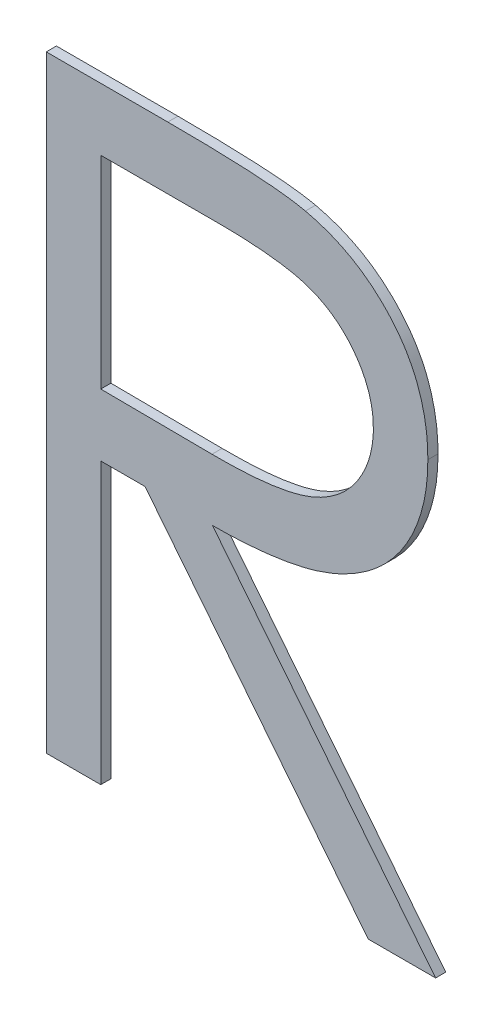
ISO-10303-21;
HEADER;
FILE_DESCRIPTION(('STEP AP214'),'2;1');
FILE_NAME('part.step','',(''),(''),'','','');
FILE_SCHEMA(('AUTOMOTIVE_DESIGN { 1 0 10303 214 1 1 1 1 }'));
ENDSEC;
DATA;
#1=APPLICATION_CONTEXT('core data for automotive mechanical design processes');
#2=APPLICATION_PROTOCOL_DEFINITION('international standard','automotive_design',2000,#1);
#3=PRODUCT_CONTEXT('',#1,'mechanical');
#4=PRODUCT('Part','Part','',(#3));
#5=PRODUCT_RELATED_PRODUCT_CATEGORY('part','',(#4));
#6=PRODUCT_DEFINITION_FORMATION('','',#4);
#7=PRODUCT_DEFINITION_CONTEXT('part definition',#1,'design');
#8=PRODUCT_DEFINITION('design','',#6,#7);
#9=PRODUCT_DEFINITION_SHAPE('','',#8);
#10=(LENGTH_UNIT() NAMED_UNIT(*) SI_UNIT(.MILLI.,.METRE.));
#11=(NAMED_UNIT(*) PLANE_ANGLE_UNIT() SI_UNIT($,.RADIAN.));
#12=(NAMED_UNIT(*) SI_UNIT($,.STERADIAN.) SOLID_ANGLE_UNIT());
#13=UNCERTAINTY_MEASURE_WITH_UNIT(LENGTH_MEASURE(1.E-05),#10,'distance_accuracy_value','');
#14=(GEOMETRIC_REPRESENTATION_CONTEXT(3) GLOBAL_UNCERTAINTY_ASSIGNED_CONTEXT((#13)) GLOBAL_UNIT_ASSIGNED_CONTEXT((#10,
#11,#12)) REPRESENTATION_CONTEXT('',''));
#15=CARTESIAN_POINT('',(0.,0.,0.));
#16=DIRECTION('',(0.,0.,1.));
#17=DIRECTION('',(1.,0.,0.));
#18=AXIS2_PLACEMENT_3D('',#15,#16,#17);
#19=CARTESIAN_POINT('',(0.729593874590072,0.249930146715529,0.551));
#20=DIRECTION('',(0.,0.,1.));
#21=DIRECTION('',(1.,0.,0.));
#22=AXIS2_PLACEMENT_3D('',#19,#20,#21);
#23=PLANE('',#22);
#24=DIRECTION('',(0.,1.,0.));
#25=VECTOR('',#24,1.);
#26=CARTESIAN_POINT('',(0.710769230769231,0.190058603834586,0.551));
#27=LINE('',#26,#25);
#28=CARTESIAN_POINT('',(0.710769230769231,0.190058603834586,0.551));
#29=VERTEX_POINT('',#28);
#30=CARTESIAN_POINT('',(0.710769230769231,0.250058603834586,0.551));
#31=VERTEX_POINT('',#30);
#32=EDGE_CURVE('E11',#29,#31,#27,.T.);
#33=ORIENTED_EDGE('',*,*,#32,.F.);
#34=DIRECTION('',(-1.,0.,0.));
#35=VECTOR('',#34,1.);
#36=CARTESIAN_POINT('',(0.716153846153846,0.190058603834586,0.551));
#37=LINE('',#36,#35);
#38=CARTESIAN_POINT('',(0.716153846153846,0.190058603834586,0.551));
#39=VERTEX_POINT('',#38);
#40=EDGE_CURVE('E364',#39,#29,#37,.T.);
#41=ORIENTED_EDGE('',*,*,#40,.F.);
#42=DIRECTION('',(0.,-1.,0.));
#43=VECTOR('',#42,1.);
#44=CARTESIAN_POINT('',(0.716153846153846,0.217750911526894,0.551));
#45=LINE('',#44,#43);
#46=CARTESIAN_POINT('',(0.716153846153846,0.217750911526894,0.551));
#47=VERTEX_POINT('',#46);
#48=EDGE_CURVE('E354',#47,#39,#45,.T.);
#49=ORIENTED_EDGE('',*,*,#48,.F.);
#50=DIRECTION('',(-1.,0.,0.));
#51=VECTOR('',#50,1.);
#52=CARTESIAN_POINT('',(0.720528846153846,0.217750911526894,0.551));
#53=LINE('',#52,#51);
#54=CARTESIAN_POINT('',(0.720528846153846,0.217750911526894,0.551));
#55=VERTEX_POINT('',#54);
#56=EDGE_CURVE('E373',#55,#47,#53,.T.);
#57=ORIENTED_EDGE('',*,*,#56,.F.);
#58=DIRECTION('',(-0.622788232243937,0.782390450976027,0.));
#59=VECTOR('',#58,1.);
#60=CARTESIAN_POINT('',(0.742572115384615,0.190058603834586,0.551));
#61=LINE('',#60,#59);
#62=CARTESIAN_POINT('',(0.742572115384615,0.190058603834586,0.551));
#63=VERTEX_POINT('',#62);
#64=EDGE_CURVE('E309',#63,#55,#61,.T.);
#65=ORIENTED_EDGE('',*,*,#64,.F.);
#66=DIRECTION('',(-1.,0.,0.));
#67=VECTOR('',#66,1.);
#68=CARTESIAN_POINT('',(0.749230769230769,0.190058603834586,0.551));
#69=LINE('',#68,#67);
#70=CARTESIAN_POINT('',(0.749230769230769,0.190058603834586,0.551));
#71=VERTEX_POINT('',#70);
#72=EDGE_CURVE('E331',#71,#63,#69,.T.);
#73=ORIENTED_EDGE('',*,*,#72,.F.);
#74=DIRECTION('',(0.622788232243938,-0.782390450976027,0.));
#75=VECTOR('',#74,1.);
#76=CARTESIAN_POINT('',(0.7271875,0.217750911526894,0.551));
#77=LINE('',#76,#75);
#78=CARTESIAN_POINT('',(0.7271875,0.217750911526894,0.551));
#79=VERTEX_POINT('',#78);
#80=EDGE_CURVE('E403',#79,#71,#77,.T.);
#81=ORIENTED_EDGE('',*,*,#80,.F.);
#82=CARTESIAN_POINT('',(0.748461538461538,0.234012930757663,0.551));
#83=CARTESIAN_POINT('',(0.748468911700596,0.233208143029153,0.551));
#84=CARTESIAN_POINT('',(0.748420557237185,0.232399911940369,0.551));
#85=CARTESIAN_POINT('',(0.748120113666604,0.230127209417305,0.551));
#86=CARTESIAN_POINT('',(0.747731522408942,0.228678847628025,0.551));
#87=CARTESIAN_POINT('',(0.746544841874727,0.225958693063811,0.551));
#88=CARTESIAN_POINT('',(0.745747972126269,0.224686388699115,0.551));
#89=CARTESIAN_POINT('',(0.743849150234613,0.222531767884124,0.551));
#90=CARTESIAN_POINT('',(0.742768337116624,0.22163065298831,0.551));
#91=CARTESIAN_POINT('',(0.740399152208515,0.220139298122198,0.551));
#92=CARTESIAN_POINT('',(0.739108595848468,0.219552644845234,0.551));
#93=CARTESIAN_POINT('',(0.73657051803808,0.21872384228478,0.551));
#94=CARTESIAN_POINT('',(0.735331493605481,0.218453220566358,0.551));
#95=CARTESIAN_POINT('',(0.732690372931943,0.218030038474797,0.551));
#96=CARTESIAN_POINT('',(0.731285937742286,0.217894675771569,0.551));
#97=CARTESIAN_POINT('',(0.728981924895038,0.217774955225404,0.551));
#98=CARTESIAN_POINT('',(0.728084212855654,0.217753612277355,0.551));
#99=CARTESIAN_POINT('',(0.7271875,0.217750911526894,0.551));
#100=B_SPLINE_CURVE_WITH_KNOTS('',3,(#82,#83,#84,#85,#86,#87,#88,#89,#90,#91,#92,#93,#94,#95,
#96,#97,#98,#99),.UNSPECIFIED.,.F.,.F.,(4,2,2,2,2,2,2,2,4),(0.,0.00241891941124372,
0.00685955805685283,0.011287009178321,0.0154491961450874,0.01965789723926,0.0234477900413579,
0.0276743955237375,0.0303661860529436),.UNSPECIFIED.);
#101=CARTESIAN_POINT('',(0.748461538461538,0.234012930757663,0.551));
#102=VERTEX_POINT('',#101);
#103=EDGE_CURVE('E264',#102,#79,#100,.T.);
#104=ORIENTED_EDGE('',*,*,#103,.F.);
#105=CARTESIAN_POINT('',(0.736370192307692,0.249241296142279,0.551));
#106=CARTESIAN_POINT('',(0.736814621233678,0.249141816509164,0.551));
#107=CARTESIAN_POINT('',(0.737256263849048,0.249024335619531,0.551));
#108=CARTESIAN_POINT('',(0.739133772910085,0.248441927544628,0.551));
#109=CARTESIAN_POINT('',(0.740520888839427,0.247799194506053,0.551));
#110=CARTESIAN_POINT('',(0.743004900221706,0.246142282236043,0.551));
#111=CARTESIAN_POINT('',(0.74410771152211,0.245136941255291,0.551));
#112=CARTESIAN_POINT('',(0.745627620083069,0.243316636377099,0.551));
#113=CARTESIAN_POINT('',(0.7461439359523,0.242581925539822,0.551));
#114=CARTESIAN_POINT('',(0.747219977404266,0.240661178806735,0.551));
#115=CARTESIAN_POINT('',(0.747689059581505,0.239423710248342,0.551));
#116=CARTESIAN_POINT('',(0.748327789570586,0.236791112392058,0.551));
#117=CARTESIAN_POINT('',(0.748477583119755,0.235390973589226,0.551));
#118=CARTESIAN_POINT('',(0.748461538461538,0.234012930757663,0.551));
#119=B_SPLINE_CURVE_WITH_KNOTS('',3,(#105,#106,#107,#108,#109,#110,#111,#112,#113,#114,#115,
#116,#117,#118),.UNSPECIFIED.,.F.,.F.,(4,2,2,2,2,2,4),(0.,0.00136892634506014,
0.00588529537116032,0.0102982950077621,0.0129784776065322,0.0168999545398443,
0.0210589177920533),.UNSPECIFIED.);
#120=CARTESIAN_POINT('',(0.736370192307692,0.249241296142279,0.551));
#121=VERTEX_POINT('',#120);
#122=EDGE_CURVE('E132',#121,#102,#119,.T.);
#123=ORIENTED_EDGE('',*,*,#122,.F.);
#124=CARTESIAN_POINT('',(0.722776442307692,0.250058603834586,0.551));
#125=CARTESIAN_POINT('',(0.723585145099272,0.250061474272542,0.551));
#126=CARTESIAN_POINT('',(0.724393816739937,0.250057101550622,0.551));
#127=CARTESIAN_POINT('',(0.726528629412481,0.250028845168755,0.551));
#128=CARTESIAN_POINT('',(0.72785463259487,0.249994263254859,0.551));
#129=CARTESIAN_POINT('',(0.729644336331593,0.249930023446547,0.551));
#130=CARTESIAN_POINT('',(0.730108424548216,0.249911769882156,0.551));
#131=CARTESIAN_POINT('',(0.730973675598888,0.249867137390712,0.551));
#132=CARTESIAN_POINT('',(0.731374916315879,0.24984217945201,0.551));
#133=CARTESIAN_POINT('',(0.732474565295955,0.249767097745879,0.551));
#134=CARTESIAN_POINT('',(0.733172794390911,0.249712032679128,0.551));
#135=CARTESIAN_POINT('',(0.734707430096043,0.24954342377603,0.551));
#136=CARTESIAN_POINT('',(0.735542675711379,0.249420171128783,0.551));
#137=CARTESIAN_POINT('',(0.736370192394004,0.249241296124493,0.551));
#138=B_SPLINE_CURVE_WITH_KNOTS('',3,(#124,#125,#126,#127,#128,#129,#130,#131,#132,#133,#134,
#135,#136,#137),.UNSPECIFIED.,.F.,.F.,(4,2,2,2,2,2,4),(0.,0.00242599521258422,
0.00640503198263672,0.0077982829429581,0.00900436448876861,0.0111044226708355,
0.0136370297981742),.UNSPECIFIED.);
#139=CARTESIAN_POINT('',(0.722776442307692,0.250058603834586,0.551));
#140=VERTEX_POINT('',#139);
#141=EDGE_CURVE('E125',#140,#121,#138,.T.);
#142=ORIENTED_EDGE('',*,*,#141,.F.);
#143=DIRECTION('',(1.,0.,0.));
#144=VECTOR('',#143,1.);
#145=CARTESIAN_POINT('',(0.710769230769231,0.250058603834586,0.551));
#146=LINE('',#145,#144);
#147=EDGE_CURVE('E129',#31,#140,#146,.T.);
#148=ORIENTED_EDGE('',*,*,#147,.F.);
#149=EDGE_LOOP('',(#33,#41,#49,#57,#65,#73,#81,#104,#123,#142,#148));
#150=FACE_BOUND('',#149,.T.);
#151=DIRECTION('',(0.,-1.,0.));
#152=VECTOR('',#151,1.);
#153=CARTESIAN_POINT('',(0.716153846153846,0.24390475768074,0.551));
#154=LINE('',#153,#152);
#155=CARTESIAN_POINT('',(0.716153846153846,0.24390475768074,0.551));
#156=VERTEX_POINT('',#155);
#157=CARTESIAN_POINT('',(0.716153846153846,0.22390475768074,0.551));
#158=VERTEX_POINT('',#157);
#159=EDGE_CURVE('E356',#156,#158,#154,.T.);
#160=ORIENTED_EDGE('',*,*,#159,.F.);
#161=DIRECTION('',(-1.,0.,0.));
#162=VECTOR('',#161,1.);
#163=CARTESIAN_POINT('',(0.727403846153846,0.24390475768074,0.551));
#164=LINE('',#163,#162);
#165=CARTESIAN_POINT('',(0.727403846153846,0.24390475768074,0.551));
#166=VERTEX_POINT('',#165);
#167=EDGE_CURVE('E350',#166,#156,#164,.T.);
#168=ORIENTED_EDGE('',*,*,#167,.F.);
#169=CARTESIAN_POINT('',(0.743076923076923,0.234024949988433,0.551));
#170=CARTESIAN_POINT('',(0.743080847364333,0.234511612914194,0.551));
#171=CARTESIAN_POINT('',(0.743043517725224,0.234999359162641,0.551));
#172=CARTESIAN_POINT('',(0.742843166419093,0.236257419105929,0.551));
#173=CARTESIAN_POINT('',(0.742617335722384,0.237018502244953,0.551));
#174=CARTESIAN_POINT('',(0.741972370076637,0.23846242663933,0.551));
#175=CARTESIAN_POINT('',(0.741550781904315,0.239144133395163,0.551));
#176=CARTESIAN_POINT('',(0.740457132995433,0.240526408229965,0.551));
#177=CARTESIAN_POINT('',(0.739751015356322,0.24120069180154,0.551));
#178=CARTESIAN_POINT('',(0.738186860024027,0.242273630921481,0.551));
#179=CARTESIAN_POINT('',(0.737334575044372,0.242680613393515,0.551));
#180=CARTESIAN_POINT('',(0.735543851949154,0.243264518902941,0.551));
#181=CARTESIAN_POINT('',(0.734603923851095,0.24343614726552,0.551));
#182=CARTESIAN_POINT('',(0.732587365455035,0.243708053945155,0.551));
#183=CARTESIAN_POINT('',(0.731509685784592,0.243795299526175,0.551));
#184=CARTESIAN_POINT('',(0.72942229365638,0.243892071044446,0.551));
#185=CARTESIAN_POINT('',(0.728412832278127,0.24390638401215,0.551));
#186=CARTESIAN_POINT('',(0.727403846153846,0.24390475768074,0.551));
#187=B_SPLINE_CURVE_WITH_KNOTS('',3,(#169,#170,#171,#172,#173,#174,#175,#176,#177,#178,#179,
#180,#181,#182,#183,#184,#185,#186),.UNSPECIFIED.,.F.,.F.,(4,2,2,2,2,2,2,2,4),(0.,
0.00146052189542925,0.003812458810781,0.0061947003220354,0.0090788318743927,0.0118682174899967,
0.0147193788174986,0.0179620276670213,0.0209888198468878),.UNSPECIFIED.);
#188=CARTESIAN_POINT('',(0.743076923076923,0.234024949988433,0.551));
#189=VERTEX_POINT('',#188);
#190=EDGE_CURVE('E345',#189,#166,#187,.T.);
#191=ORIENTED_EDGE('',*,*,#190,.F.);
#192=CARTESIAN_POINT('',(0.727139423076923,0.223820623065356,0.551));
#193=CARTESIAN_POINT('',(0.72765665936159,0.223820500130313,0.551));
#194=CARTESIAN_POINT('',(0.728174473092298,0.22382356010618,0.551));
#195=CARTESIAN_POINT('',(0.730412078565539,0.22386433604423,0.551));
#196=CARTESIAN_POINT('',(0.732132146632148,0.223966004860115,0.551));
#197=CARTESIAN_POINT('',(0.735063563066817,0.224464243413341,0.551));
#198=CARTESIAN_POINT('',(0.736284347031616,0.224771721081371,0.551));
#199=CARTESIAN_POINT('',(0.738370757112794,0.225713816948197,0.551));
#200=CARTESIAN_POINT('',(0.739261697618529,0.226285640795418,0.551));
#201=CARTESIAN_POINT('',(0.740633969355859,0.227546913128135,0.551));
#202=CARTESIAN_POINT('',(0.741162034923664,0.228186373288074,0.551));
#203=CARTESIAN_POINT('',(0.742045773079109,0.22958609989474,0.551));
#204=CARTESIAN_POINT('',(0.742399151537132,0.230347808443954,0.551));
#205=CARTESIAN_POINT('',(0.742940357953151,0.232071540001432,0.551));
#206=CARTESIAN_POINT('',(0.74308988867121,0.233045615172945,0.551));
#207=CARTESIAN_POINT('',(0.743076923076923,0.234024949988433,0.551));
#208=B_SPLINE_CURVE_WITH_KNOTS('',3,(#192,#193,#194,#195,#196,#197,#198,#199,#200,#201,#202,
#203,#204,#205,#206,#207),.UNSPECIFIED.,.F.,.F.,(4,2,2,2,2,2,2,4),(0.,0.00155294059489081,
0.00671029616850906,0.0104448873224616,0.0135593956664882,0.0160192505473629,0.0185106045531862,
0.0214249742693337),.UNSPECIFIED.);
#209=CARTESIAN_POINT('',(0.727139423076923,0.223820623065356,0.551));
#210=VERTEX_POINT('',#209);
#211=EDGE_CURVE('E302',#210,#189,#208,.T.);
#212=ORIENTED_EDGE('',*,*,#211,.F.);
#213=DIRECTION('',(0.999970673881285,-0.0076584187277561,0.));
#214=VECTOR('',#213,1.);
#215=CARTESIAN_POINT('',(0.716153846153846,0.22390475768074,0.551));
#216=LINE('',#215,#214);
#217=EDGE_CURVE('E332',#158,#210,#216,.T.);
#218=ORIENTED_EDGE('',*,*,#217,.F.);
#219=EDGE_LOOP('',(#160,#168,#191,#212,#218));
#220=FACE_BOUND('',#219,.T.);
#221=ADVANCED_FACE('F17',(#150,#220),#23,.T.);
#222=CARTESIAN_POINT('',(0.729593874590072,0.249930146715529,0.55));
#223=DIRECTION('',(0.,0.,1.));
#224=DIRECTION('',(1.,0.,0.));
#225=AXIS2_PLACEMENT_3D('',#222,#223,#224);
#226=PLANE('',#225);
#227=DIRECTION('',(0.,1.,0.));
#228=VECTOR('',#227,1.);
#229=CARTESIAN_POINT('',(0.710769230769231,0.190058603834586,0.55));
#230=LINE('',#229,#228);
#231=CARTESIAN_POINT('',(0.710769230769231,0.190058603834586,0.55));
#232=VERTEX_POINT('',#231);
#233=CARTESIAN_POINT('',(0.710769230769231,0.250058603834586,0.55));
#234=VERTEX_POINT('',#233);
#235=EDGE_CURVE('E25',#232,#234,#230,.T.);
#236=ORIENTED_EDGE('',*,*,#235,.T.);
#237=DIRECTION('',(1.,0.,0.));
#238=VECTOR('',#237,1.);
#239=CARTESIAN_POINT('',(0.710769230769231,0.250058603834586,0.55));
#240=LINE('',#239,#238);
#241=CARTESIAN_POINT('',(0.722776442307692,0.250058603834586,0.55));
#242=VERTEX_POINT('',#241);
#243=EDGE_CURVE('E353',#234,#242,#240,.T.);
#244=ORIENTED_EDGE('',*,*,#243,.T.);
#245=CARTESIAN_POINT('',(0.722776442307692,0.250058603834586,0.55));
#246=CARTESIAN_POINT('',(0.723585145099507,0.250061474275804,0.55));
#247=CARTESIAN_POINT('',(0.724393816740083,0.250057101552648,0.55));
#248=CARTESIAN_POINT('',(0.726528629412242,0.250028845165432,0.55));
#249=CARTESIAN_POINT('',(0.727854632594238,0.249994263246085,0.55));
#250=CARTESIAN_POINT('',(0.729644337122473,0.24993002342124,0.55));
#251=CARTESIAN_POINT('',(0.730108426129917,0.249911769827856,0.55));
#252=CARTESIAN_POINT('',(0.730973678758569,0.249867137217125,0.55));
#253=CARTESIAN_POINT('',(0.731374920263071,0.249842179193905,0.55));
#254=CARTESIAN_POINT('',(0.732474568447577,0.249767097448339,0.55));
#255=CARTESIAN_POINT('',(0.73317279596092,0.24971203248205,0.55));
#256=CARTESIAN_POINT('',(0.734707430098889,0.249543423805363,0.55));
#257=CARTESIAN_POINT('',(0.735542675717145,0.249420171187483,0.55));
#258=CARTESIAN_POINT('',(0.736370192394004,0.249241296124493,0.55));
#259=B_SPLINE_CURVE_WITH_KNOTS('',3,(#245,#246,#247,#248,#249,#250,#251,#252,#253,#254,#255,
#256,#257,#258),.UNSPECIFIED.,.F.,.F.,(4,2,2,2,2,2,4),(0.,0.00242599521258422,
0.00640503198263672,0.0077982853163376,0.0090043692354748,0.0111044226709654,0.013637029798304),.UNSPECIFIED.);
#260=CARTESIAN_POINT('',(0.736370192307692,0.249241296142279,0.55));
#261=VERTEX_POINT('',#260);
#262=EDGE_CURVE('E143',#242,#261,#259,.T.);
#263=ORIENTED_EDGE('',*,*,#262,.T.);
#264=CARTESIAN_POINT('',(0.736370192307692,0.249241296142279,0.55));
#265=CARTESIAN_POINT('',(0.736814621233678,0.249141816509164,0.55));
#266=CARTESIAN_POINT('',(0.737256263849048,0.249024335619531,0.55));
#267=CARTESIAN_POINT('',(0.739133772910085,0.248441927544628,0.55));
#268=CARTESIAN_POINT('',(0.740520888839427,0.247799194506053,0.55));
#269=CARTESIAN_POINT('',(0.743004900221706,0.246142282236043,0.55));
#270=CARTESIAN_POINT('',(0.74410771152211,0.245136941255291,0.55));
#271=CARTESIAN_POINT('',(0.745627620083069,0.243316636377099,0.55));
#272=CARTESIAN_POINT('',(0.7461439359523,0.242581925539822,0.55));
#273=CARTESIAN_POINT('',(0.747219977404266,0.240661178806735,0.55));
#274=CARTESIAN_POINT('',(0.747689059581505,0.239423710248342,0.55));
#275=CARTESIAN_POINT('',(0.748327789570586,0.236791112392058,0.55));
#276=CARTESIAN_POINT('',(0.748477583119755,0.235390973589226,0.55));
#277=CARTESIAN_POINT('',(0.748461538461538,0.234012930757663,0.55));
#278=B_SPLINE_CURVE_WITH_KNOTS('',3,(#264,#265,#266,#267,#268,#269,#270,#271,#272,#273,#274,
#275,#276,#277),.UNSPECIFIED.,.F.,.F.,(4,2,2,2,2,2,4),(0.,0.00136892634506014,
0.00588529537116032,0.0102982950077621,0.0129784776065322,0.0168999545398443,
0.0210589177920533),.UNSPECIFIED.);
#279=CARTESIAN_POINT('',(0.748461538461538,0.234012930757663,0.55));
#280=VERTEX_POINT('',#279);
#281=EDGE_CURVE('E225',#261,#280,#278,.T.);
#282=ORIENTED_EDGE('',*,*,#281,.T.);
#283=CARTESIAN_POINT('',(0.748461538461538,0.234012930757663,0.55));
#284=CARTESIAN_POINT('',(0.748468911700596,0.233208143029153,0.55));
#285=CARTESIAN_POINT('',(0.748420557237185,0.232399911940369,0.55));
#286=CARTESIAN_POINT('',(0.748120113666604,0.230127209417305,0.55));
#287=CARTESIAN_POINT('',(0.747731522408942,0.228678847628025,0.55));
#288=CARTESIAN_POINT('',(0.746544841874727,0.225958693063811,0.55));
#289=CARTESIAN_POINT('',(0.745747972126269,0.224686388699115,0.55));
#290=CARTESIAN_POINT('',(0.743849150234613,0.222531767884124,0.55));
#291=CARTESIAN_POINT('',(0.742768337116624,0.22163065298831,0.55));
#292=CARTESIAN_POINT('',(0.740399152208515,0.220139298122198,0.55));
#293=CARTESIAN_POINT('',(0.739108595848468,0.219552644845234,0.55));
#294=CARTESIAN_POINT('',(0.73657051803808,0.21872384228478,0.55));
#295=CARTESIAN_POINT('',(0.735331493605481,0.218453220566358,0.55));
#296=CARTESIAN_POINT('',(0.732690372931943,0.218030038474797,0.55));
#297=CARTESIAN_POINT('',(0.731285937742286,0.217894675771569,0.55));
#298=CARTESIAN_POINT('',(0.728981924895038,0.217774955225404,0.55));
#299=CARTESIAN_POINT('',(0.728084212855654,0.217753612277355,0.55));
#300=CARTESIAN_POINT('',(0.7271875,0.217750911526894,0.55));
#301=B_SPLINE_CURVE_WITH_KNOTS('',3,(#283,#284,#285,#286,#287,#288,#289,#290,#291,#292,#293,
#294,#295,#296,#297,#298,#299,#300),.UNSPECIFIED.,.F.,.F.,(4,2,2,2,2,2,2,2,4),(0.,
0.00241891941124372,0.00685955805685283,0.011287009178321,0.0154491961450874,0.01965789723926,
0.0234477900413579,0.0276743955237375,0.0303661860529436),.UNSPECIFIED.);
#302=CARTESIAN_POINT('',(0.7271875,0.217750911526894,0.55));
#303=VERTEX_POINT('',#302);
#304=EDGE_CURVE('E217',#280,#303,#301,.T.);
#305=ORIENTED_EDGE('',*,*,#304,.T.);
#306=DIRECTION('',(0.622788232243938,-0.782390450976027,0.));
#307=VECTOR('',#306,1.);
#308=CARTESIAN_POINT('',(0.7271875,0.217750911526894,0.55));
#309=LINE('',#308,#307);
#310=CARTESIAN_POINT('',(0.749230769230769,0.190058603834586,0.55));
#311=VERTEX_POINT('',#310);
#312=EDGE_CURVE('E396',#303,#311,#309,.T.);
#313=ORIENTED_EDGE('',*,*,#312,.T.);
#314=DIRECTION('',(-1.,0.,0.));
#315=VECTOR('',#314,1.);
#316=CARTESIAN_POINT('',(0.749230769230769,0.190058603834586,0.55));
#317=LINE('',#316,#315);
#318=CARTESIAN_POINT('',(0.742572115384615,0.190058603834586,0.55));
#319=VERTEX_POINT('',#318);
#320=EDGE_CURVE('E393',#311,#319,#317,.T.);
#321=ORIENTED_EDGE('',*,*,#320,.T.);
#322=DIRECTION('',(-0.622788232243937,0.782390450976027,0.));
#323=VECTOR('',#322,1.);
#324=CARTESIAN_POINT('',(0.742572115384615,0.190058603834586,0.55));
#325=LINE('',#324,#323);
#326=CARTESIAN_POINT('',(0.720528846153846,0.217750911526894,0.55));
#327=VERTEX_POINT('',#326);
#328=EDGE_CURVE('E391',#319,#327,#325,.T.);
#329=ORIENTED_EDGE('',*,*,#328,.T.);
#330=DIRECTION('',(-1.,0.,0.));
#331=VECTOR('',#330,1.);
#332=CARTESIAN_POINT('',(0.720528846153846,0.217750911526894,0.55));
#333=LINE('',#332,#331);
#334=CARTESIAN_POINT('',(0.716153846153846,0.217750911526894,0.55));
#335=VERTEX_POINT('',#334);
#336=EDGE_CURVE('E310',#327,#335,#333,.T.);
#337=ORIENTED_EDGE('',*,*,#336,.T.);
#338=DIRECTION('',(0.,-1.,0.));
#339=VECTOR('',#338,1.);
#340=CARTESIAN_POINT('',(0.716153846153846,0.217750911526894,0.55));
#341=LINE('',#340,#339);
#342=CARTESIAN_POINT('',(0.716153846153846,0.190058603834586,0.55));
#343=VERTEX_POINT('',#342);
#344=EDGE_CURVE('E379',#335,#343,#341,.T.);
#345=ORIENTED_EDGE('',*,*,#344,.T.);
#346=DIRECTION('',(-1.,0.,0.));
#347=VECTOR('',#346,1.);
#348=CARTESIAN_POINT('',(0.716153846153846,0.190058603834586,0.55));
#349=LINE('',#348,#347);
#350=EDGE_CURVE('E388',#343,#232,#349,.T.);
#351=ORIENTED_EDGE('',*,*,#350,.T.);
#352=EDGE_LOOP('',(#236,#244,#263,#282,#305,#313,#321,#329,#337,#345,#351));
#353=FACE_BOUND('',#352,.T.);
#354=DIRECTION('',(-1.,0.,0.));
#355=VECTOR('',#354,1.);
#356=CARTESIAN_POINT('',(0.727403846153846,0.24390475768074,0.55));
#357=LINE('',#356,#355);
#358=CARTESIAN_POINT('',(0.727403846153846,0.24390475768074,0.55));
#359=VERTEX_POINT('',#358);
#360=CARTESIAN_POINT('',(0.716153846153846,0.24390475768074,0.55));
#361=VERTEX_POINT('',#360);
#362=EDGE_CURVE('E351',#359,#361,#357,.T.);
#363=ORIENTED_EDGE('',*,*,#362,.T.);
#364=DIRECTION('',(0.,-1.,0.));
#365=VECTOR('',#364,1.);
#366=CARTESIAN_POINT('',(0.716153846153846,0.24390475768074,0.55));
#367=LINE('',#366,#365);
#368=CARTESIAN_POINT('',(0.716153846153846,0.22390475768074,0.55));
#369=VERTEX_POINT('',#368);
#370=EDGE_CURVE('E187',#361,#369,#367,.T.);
#371=ORIENTED_EDGE('',*,*,#370,.T.);
#372=DIRECTION('',(0.999970673881285,-0.0076584187277561,0.));
#373=VECTOR('',#372,1.);
#374=CARTESIAN_POINT('',(0.716153846153846,0.22390475768074,0.55));
#375=LINE('',#374,#373);
#376=CARTESIAN_POINT('',(0.727139423076923,0.223820623065356,0.55));
#377=VERTEX_POINT('',#376);
#378=EDGE_CURVE('E234',#369,#377,#375,.T.);
#379=ORIENTED_EDGE('',*,*,#378,.T.);
#380=CARTESIAN_POINT('',(0.727139423076923,0.223820623065356,0.55));
#381=CARTESIAN_POINT('',(0.72765665936159,0.223820500130313,0.55));
#382=CARTESIAN_POINT('',(0.728174473092298,0.22382356010618,0.55));
#383=CARTESIAN_POINT('',(0.730412078565539,0.22386433604423,0.55));
#384=CARTESIAN_POINT('',(0.732132146632148,0.223966004860115,0.55));
#385=CARTESIAN_POINT('',(0.735063563066817,0.224464243413341,0.55));
#386=CARTESIAN_POINT('',(0.736284347031616,0.224771721081371,0.55));
#387=CARTESIAN_POINT('',(0.738370757112794,0.225713816948197,0.55));
#388=CARTESIAN_POINT('',(0.739261697618529,0.226285640795418,0.55));
#389=CARTESIAN_POINT('',(0.740633969355859,0.227546913128135,0.55));
#390=CARTESIAN_POINT('',(0.741162034923664,0.228186373288074,0.55));
#391=CARTESIAN_POINT('',(0.742045773079109,0.22958609989474,0.55));
#392=CARTESIAN_POINT('',(0.742399151537132,0.230347808443954,0.55));
#393=CARTESIAN_POINT('',(0.742940357953151,0.232071540001431,0.55));
#394=CARTESIAN_POINT('',(0.74308988867121,0.233045615172945,0.55));
#395=CARTESIAN_POINT('',(0.743076923076923,0.234024949988432,0.55));
#396=B_SPLINE_CURVE_WITH_KNOTS('',3,(#380,#381,#382,#383,#384,#385,#386,#387,#388,#389,#390,
#391,#392,#393,#394,#395),.UNSPECIFIED.,.F.,.F.,(4,2,2,2,2,2,2,4),(0.,0.00155294059489081,
0.00671029616850906,0.0104448873224616,0.0135593956664882,0.0160192505473629,0.0185106045531862,
0.0214249742693327),.UNSPECIFIED.);
#397=CARTESIAN_POINT('',(0.743076923076923,0.234024949988432,0.55));
#398=VERTEX_POINT('',#397);
#399=EDGE_CURVE('E209',#377,#398,#396,.T.);
#400=ORIENTED_EDGE('',*,*,#399,.T.);
#401=CARTESIAN_POINT('',(0.743076923076923,0.234024949988432,0.55));
#402=CARTESIAN_POINT('',(0.743080847364333,0.234511612914194,0.55));
#403=CARTESIAN_POINT('',(0.743043517725224,0.23499935916264,0.55));
#404=CARTESIAN_POINT('',(0.742843166419093,0.236257419105929,0.55));
#405=CARTESIAN_POINT('',(0.742617335722386,0.237018502244953,0.55));
#406=CARTESIAN_POINT('',(0.741972370076638,0.23846242663933,0.55));
#407=CARTESIAN_POINT('',(0.741550781904315,0.239144133395163,0.55));
#408=CARTESIAN_POINT('',(0.740457132995433,0.240526408229964,0.55));
#409=CARTESIAN_POINT('',(0.739751015356322,0.241200691801539,0.55));
#410=CARTESIAN_POINT('',(0.738186860024028,0.242273630921481,0.55));
#411=CARTESIAN_POINT('',(0.737334575044373,0.242680613393515,0.55));
#412=CARTESIAN_POINT('',(0.735543851949155,0.243264518902941,0.55));
#413=CARTESIAN_POINT('',(0.734603923851096,0.24343614726552,0.55));
#414=CARTESIAN_POINT('',(0.732587365455036,0.243708053945155,0.55));
#415=CARTESIAN_POINT('',(0.731509685784593,0.243795299526175,0.55));
#416=CARTESIAN_POINT('',(0.72942229365638,0.243892071044446,0.55));
#417=CARTESIAN_POINT('',(0.728412832278127,0.24390638401215,0.55));
#418=CARTESIAN_POINT('',(0.727403846153846,0.24390475768074,0.55));
#419=B_SPLINE_CURVE_WITH_KNOTS('',3,(#401,#402,#403,#404,#405,#406,#407,#408,#409,#410,#411,
#412,#413,#414,#415,#416,#417,#418),.UNSPECIFIED.,.F.,.F.,(4,2,2,2,2,2,2,2,4),(0.,
0.00146052189543025,0.0038124588107817,0.00619470032203665,0.00907883187439395,
0.011868217489997,0.014719378817499,0.0179620276670217,0.0209888198468892),.UNSPECIFIED.);
#420=EDGE_CURVE('E199',#398,#359,#419,.T.);
#421=ORIENTED_EDGE('',*,*,#420,.T.);
#422=EDGE_LOOP('',(#363,#371,#379,#400,#421));
#423=FACE_BOUND('',#422,.T.);
#424=ADVANCED_FACE('F190',(#353,#423),#226,.F.);
#425=CARTESIAN_POINT('',(0.710769230769231,0.190058603834586,0.551));
#426=DIRECTION('',(-1.,0.,0.));
#427=DIRECTION('',(0.,0.,1.));
#428=AXIS2_PLACEMENT_3D('',#425,#426,#427);
#429=PLANE('',#428);
#430=ORIENTED_EDGE('',*,*,#235,.F.);
#431=DIRECTION('',(0.,0.,-1.));
#432=VECTOR('',#431,1.);
#433=CARTESIAN_POINT('',(0.710769230769231,0.190058603834586,0.551));
#434=LINE('',#433,#432);
#435=EDGE_CURVE('E186',#29,#232,#434,.T.);
#436=ORIENTED_EDGE('',*,*,#435,.F.);
#437=ORIENTED_EDGE('',*,*,#32,.T.);
#438=DIRECTION('',(0.,0.,-1.));
#439=VECTOR('',#438,1.);
#440=CARTESIAN_POINT('',(0.710769230769231,0.250058603834586,0.551));
#441=LINE('',#440,#439);
#442=EDGE_CURVE('E150',#31,#234,#441,.T.);
#443=ORIENTED_EDGE('',*,*,#442,.T.);
#444=EDGE_LOOP('',(#430,#436,#437,#443));
#445=FACE_BOUND('',#444,.T.);
#446=ADVANCED_FACE('F194',(#445),#429,.T.);
#447=CARTESIAN_POINT('',(0.716153846153846,0.190058603834586,0.551));
#448=DIRECTION('',(0.,-1.,0.));
#449=DIRECTION('',(0.,0.,-1.));
#450=AXIS2_PLACEMENT_3D('',#447,#448,#449);
#451=PLANE('',#450);
#452=ORIENTED_EDGE('',*,*,#350,.F.);
#453=DIRECTION('',(-1.11022302462503E-13,0.,-1.));
#454=VECTOR('',#453,1.);
#455=CARTESIAN_POINT('',(0.716153846153846,0.190058603834586,0.551));
#456=LINE('',#455,#454);
#457=EDGE_CURVE('E233',#39,#343,#456,.T.);
#458=ORIENTED_EDGE('',*,*,#457,.F.);
#459=ORIENTED_EDGE('',*,*,#40,.T.);
#460=ORIENTED_EDGE('',*,*,#435,.T.);
#461=EDGE_LOOP('',(#452,#458,#459,#460));
#462=FACE_BOUND('',#461,.T.);
#463=ADVANCED_FACE('F369',(#462),#451,.T.);
#464=CARTESIAN_POINT('',(0.716153846153846,0.217750911526894,0.551));
#465=DIRECTION('',(1.,0.,0.));
#466=DIRECTION('',(0.,0.,-1.));
#467=AXIS2_PLACEMENT_3D('',#464,#465,#466);
#468=PLANE('',#467);
#469=ORIENTED_EDGE('',*,*,#344,.F.);
#470=DIRECTION('',(-1.11022302462503E-13,0.,-1.));
#471=VECTOR('',#470,1.);
#472=CARTESIAN_POINT('',(0.716153846153846,0.217750911526894,0.551));
#473=LINE('',#472,#471);
#474=EDGE_CURVE('E377',#47,#335,#473,.T.);
#475=ORIENTED_EDGE('',*,*,#474,.F.);
#476=ORIENTED_EDGE('',*,*,#48,.T.);
#477=ORIENTED_EDGE('',*,*,#457,.T.);
#478=EDGE_LOOP('',(#469,#475,#476,#477));
#479=FACE_BOUND('',#478,.T.);
#480=ADVANCED_FACE('F171',(#479),#468,.T.);
#481=CARTESIAN_POINT('',(0.720528846153846,0.217750911526894,0.551));
#482=DIRECTION('',(0.,-1.,0.));
#483=DIRECTION('',(0.,0.,-1.));
#484=AXIS2_PLACEMENT_3D('',#481,#482,#483);
#485=PLANE('',#484);
#486=ORIENTED_EDGE('',*,*,#336,.F.);
#487=DIRECTION('',(0.,0.,-1.));
#488=VECTOR('',#487,1.);
#489=CARTESIAN_POINT('',(0.720528846153846,0.217750911526894,0.551));
#490=LINE('',#489,#488);
#491=EDGE_CURVE('E382',#55,#327,#490,.T.);
#492=ORIENTED_EDGE('',*,*,#491,.F.);
#493=ORIENTED_EDGE('',*,*,#56,.T.);
#494=ORIENTED_EDGE('',*,*,#474,.T.);
#495=EDGE_LOOP('',(#486,#492,#493,#494));
#496=FACE_BOUND('',#495,.T.);
#497=ADVANCED_FACE('F169',(#496),#485,.T.);
#498=CARTESIAN_POINT('',(0.742572115384615,0.190058603834586,0.551));
#499=DIRECTION('',(-0.782390450976027,-0.622788232243938,0.));
#500=DIRECTION('',(0.622788232243938,-0.782390450976027,0.));
#501=AXIS2_PLACEMENT_3D('',#498,#499,#500);
#502=PLANE('',#501);
#503=ORIENTED_EDGE('',*,*,#328,.F.);
#504=DIRECTION('',(0.,0.,-1.));
#505=VECTOR('',#504,1.);
#506=CARTESIAN_POINT('',(0.742572115384615,0.190058603834586,0.551));
#507=LINE('',#506,#505);
#508=EDGE_CURVE('E271',#63,#319,#507,.T.);
#509=ORIENTED_EDGE('',*,*,#508,.F.);
#510=ORIENTED_EDGE('',*,*,#64,.T.);
#511=ORIENTED_EDGE('',*,*,#491,.T.);
#512=EDGE_LOOP('',(#503,#509,#510,#511));
#513=FACE_BOUND('',#512,.T.);
#514=ADVANCED_FACE('F294',(#513),#502,.T.);
#515=CARTESIAN_POINT('',(0.749230769230769,0.190058603834586,0.551));
#516=DIRECTION('',(0.,-1.,0.));
#517=DIRECTION('',(0.,0.,-1.));
#518=AXIS2_PLACEMENT_3D('',#515,#516,#517);
#519=PLANE('',#518);
#520=ORIENTED_EDGE('',*,*,#320,.F.);
#521=DIRECTION('',(0.,0.,-1.));
#522=VECTOR('',#521,1.);
#523=CARTESIAN_POINT('',(0.749230769230769,0.190058603834586,0.551));
#524=LINE('',#523,#522);
#525=EDGE_CURVE('E261',#71,#311,#524,.T.);
#526=ORIENTED_EDGE('',*,*,#525,.F.);
#527=ORIENTED_EDGE('',*,*,#72,.T.);
#528=ORIENTED_EDGE('',*,*,#508,.T.);
#529=EDGE_LOOP('',(#520,#526,#527,#528));
#530=FACE_BOUND('',#529,.T.);
#531=ADVANCED_FACE('F280',(#530),#519,.T.);
#532=CARTESIAN_POINT('',(0.7271875,0.217750911526894,0.551));
#533=DIRECTION('',(0.782390450976027,0.622788232243938,0.));
#534=DIRECTION('',(-0.622788232243938,0.782390450976027,0.));
#535=AXIS2_PLACEMENT_3D('',#532,#533,#534);
#536=PLANE('',#535);
#537=ORIENTED_EDGE('',*,*,#312,.F.);
#538=DIRECTION('',(0.,0.,-1.));
#539=VECTOR('',#538,1.);
#540=CARTESIAN_POINT('',(0.7271875,0.217750911526894,0.551));
#541=LINE('',#540,#539);
#542=EDGE_CURVE('E136',#79,#303,#541,.T.);
#543=ORIENTED_EDGE('',*,*,#542,.F.);
#544=ORIENTED_EDGE('',*,*,#80,.T.);
#545=ORIENTED_EDGE('',*,*,#525,.T.);
#546=EDGE_LOOP('',(#537,#543,#544,#545));
#547=FACE_BOUND('',#546,.T.);
#548=ADVANCED_FACE('F278',(#547),#536,.T.);
#549=CARTESIAN_POINT('',(0.748461538461538,0.234012930757663,0.551));
#550=CARTESIAN_POINT('',(0.748461538461538,0.234012930757663,0.55));
#551=CARTESIAN_POINT('',(0.748436355636821,0.233213471821476,0.551));
#552=CARTESIAN_POINT('',(0.748436355636821,0.233213471821476,0.55));
#553=CARTESIAN_POINT('',(0.748387217423284,0.231653520371966,0.551));
#554=CARTESIAN_POINT('',(0.748387217423284,0.231653520371966,0.55));
#555=CARTESIAN_POINT('',(0.74792907278877,0.229389619547816,0.551));
#556=CARTESIAN_POINT('',(0.74792907278877,0.229389619547816,0.55));
#557=CARTESIAN_POINT('',(0.747178618164848,0.227277802725408,0.551));
#558=CARTESIAN_POINT('',(0.747178618164848,0.227277802725408,0.55));
#559=CARTESIAN_POINT('',(0.746144504638974,0.225320728932572,0.551));
#560=CARTESIAN_POINT('',(0.746144504638974,0.225320728932572,0.55));
#561=CARTESIAN_POINT('',(0.744827599341029,0.223556546440684,0.551));
#562=CARTESIAN_POINT('',(0.744827599341029,0.223556546440684,0.55));
#563=CARTESIAN_POINT('',(0.7432448886364,0.222006995778331,0.551));
#564=CARTESIAN_POINT('',(0.7432448886364,0.222006995778331,0.55));
#565=CARTESIAN_POINT('',(0.741395489582291,0.220710311562489,0.551));
#566=CARTESIAN_POINT('',(0.741395489582291,0.220710311562489,0.55));
#567=CARTESIAN_POINT('',(0.739673844166191,0.219811120624749,0.551));
#568=CARTESIAN_POINT('',(0.739673844166191,0.219811120624749,0.55));
#569=CARTESIAN_POINT('',(0.738153029314249,0.219235242191182,0.551));
#570=CARTESIAN_POINT('',(0.738153029314249,0.219235242191182,0.55));
#571=CARTESIAN_POINT('',(0.736901029666454,0.218830047467884,0.551));
#572=CARTESIAN_POINT('',(0.736901029666454,0.218830047467884,0.55));
#573=CARTESIAN_POINT('',(0.73553531005224,0.218516985205991,0.551));
#574=CARTESIAN_POINT('',(0.73553531005224,0.218516985205991,0.55));
#575=CARTESIAN_POINT('',(0.734068955744711,0.218236525804209,0.551));
#576=CARTESIAN_POINT('',(0.734068955744711,0.218236525804209,0.55));
#577=CARTESIAN_POINT('',(0.732495864507703,0.218024782471441,0.551));
#578=CARTESIAN_POINT('',(0.732495864507703,0.218024782471441,0.55));
#579=CARTESIAN_POINT('',(0.730819806689602,0.217869697994823,0.551));
#580=CARTESIAN_POINT('',(0.730819806689602,0.217869697994823,0.55));
#581=CARTESIAN_POINT('',(0.729039586947372,0.217772771445709,0.551));
#582=CARTESIAN_POINT('',(0.729039586947372,0.217772771445709,0.549999999999999));
#583=CARTESIAN_POINT('',(0.727816631472747,0.217758337076185,0.551));
#584=CARTESIAN_POINT('',(0.727816631472747,0.217758337076185,0.55));
#585=CARTESIAN_POINT('',(0.7271875,0.217750911526894,0.551));
#586=CARTESIAN_POINT('',(0.7271875,0.217750911526894,0.55));
#587=B_SPLINE_SURFACE_WITH_KNOTS('',3,1,((#549,#550),(#551,#552),(#553,#554),(#555,#556),(#557,
#558),(#559,#560),(#561,#562),(#563,#564),(#565,#566),(#567,#568),(#569,#570),(#571,#572),(#573,
#574),(#575,#576),(#577,#578),(#579,#580),(#581,#582),(#583,#584),(#585,#586)),.UNSPECIFIED.,
.F.,.F.,.F.,(4,1,1,1,1,1,1,1,1,1,1,1,1,1,1,1,4),(2,2),(0.,0.0787802355821401,0.153720644208585,
0.226713530308782,0.299191166065937,0.371189996837668,0.443006414353411,0.516689173294881,
0.593217216623411,0.633872917807845,0.67698914228998,0.722899506325827,0.771958610506144,
0.824211323334835,0.879378650627204,0.937948119330419,1.),(0.,1.),.UNSPECIFIED.);
#588=DIRECTION('',(-1.11022302462503E-13,0.,-1.));
#589=VECTOR('',#588,1.);
#590=CARTESIAN_POINT('',(0.748461538461538,0.234012930757663,0.551));
#591=LINE('',#590,#589);
#592=EDGE_CURVE('E137',#102,#280,#591,.T.);
#593=ORIENTED_EDGE('',*,*,#304,.F.);
#594=ORIENTED_EDGE('',*,*,#592,.F.);
#595=ORIENTED_EDGE('',*,*,#103,.T.);
#596=ORIENTED_EDGE('',*,*,#542,.T.);
#597=EDGE_LOOP('',(#593,#594,#595,#596));
#598=FACE_BOUND('',#597,.T.);
#599=ADVANCED_FACE('F242',(#598),#587,.T.);
#600=CARTESIAN_POINT('',(0.736370192307692,0.249241296142279,0.551));
#601=CARTESIAN_POINT('',(0.736370192307692,0.249241296142279,0.55));
#602=CARTESIAN_POINT('',(0.736809163007181,0.24913283730744,0.551));
#603=CARTESIAN_POINT('',(0.736809163007181,0.24913283730744,0.55));
#604=CARTESIAN_POINT('',(0.737677739969553,0.248918233359122,0.551));
#605=CARTESIAN_POINT('',(0.737677739969553,0.248918233359122,0.55));
#606=CARTESIAN_POINT('',(0.738928312530237,0.248464640202145,0.551));
#607=CARTESIAN_POINT('',(0.738928312530237,0.248464640202145,0.55));
#608=CARTESIAN_POINT('',(0.740119986655124,0.247939732351436,0.551));
#609=CARTESIAN_POINT('',(0.740119986655124,0.247939732351436,0.55));
#610=CARTESIAN_POINT('',(0.741247812214925,0.247323211431697,0.551));
#611=CARTESIAN_POINT('',(0.741247812214925,0.247323211431697,0.55));
#612=CARTESIAN_POINT('',(0.742306140063903,0.246610500923026,0.551));
#613=CARTESIAN_POINT('',(0.742306140063903,0.246610500923026,0.55));
#614=CARTESIAN_POINT('',(0.74330588253467,0.245813904538423,0.551));
#615=CARTESIAN_POINT('',(0.74330588253467,0.245813904538423,0.55));
#616=CARTESIAN_POINT('',(0.744251576192612,0.244937781010929,0.551));
#617=CARTESIAN_POINT('',(0.744251576192612,0.244937781010929,0.55));
#618=CARTESIAN_POINT('',(0.745104975567132,0.243960040870884,0.551));
#619=CARTESIAN_POINT('',(0.745104975567132,0.243960040870884,0.55));
#620=CARTESIAN_POINT('',(0.745909645024753,0.242934272133512,0.551));
#621=CARTESIAN_POINT('',(0.745909645024753,0.242934272133512,0.55));
#622=CARTESIAN_POINT('',(0.746588307193334,0.241825064873378,0.551));
#623=CARTESIAN_POINT('',(0.746588307193334,0.241825064873378,0.55));
#624=CARTESIAN_POINT('',(0.747173332560005,0.240665152972966,0.551));
#625=CARTESIAN_POINT('',(0.747173332560005,0.240665152972966,0.55));
#626=CARTESIAN_POINT('',(0.747639112851437,0.239442740097158,0.551));
#627=CARTESIAN_POINT('',(0.747639112851437,0.239442740097158,0.55));
#628=CARTESIAN_POINT('',(0.748014163825262,0.238169681150942,0.551));
#629=CARTESIAN_POINT('',(0.748014163825262,0.238169681150942,0.55));
#630=CARTESIAN_POINT('',(0.74827861364305,0.236834444635618,0.551));
#631=CARTESIAN_POINT('',(0.74827861364305,0.236834444635618,0.55));
#632=CARTESIAN_POINT('',(0.748437205431007,0.23544311363418,0.551));
#633=CARTESIAN_POINT('',(0.748437205431007,0.23544311363418,0.55));
#634=CARTESIAN_POINT('',(0.74845335152621,0.234494120912038,0.551));
#635=CARTESIAN_POINT('',(0.74845335152621,0.234494120912038,0.55));
#636=CARTESIAN_POINT('',(0.748461538461538,0.234012930757663,0.551));
#637=CARTESIAN_POINT('',(0.748461538461538,0.234012930757663,0.55));
#638=B_SPLINE_SURFACE_WITH_KNOTS('',3,1,((#600,#601),(#602,#603),(#604,#605),(#606,#607),(#608,
#609),(#610,#611),(#612,#613),(#614,#615),(#616,#617),(#618,#619),(#620,#621),(#622,#623),(#624,
#625),(#626,#627),(#628,#629),(#630,#631),(#632,#633),(#634,#635),(#636,#637)),.UNSPECIFIED.,
.F.,.F.,.F.,(4,1,1,1,1,1,1,1,1,1,1,1,1,1,1,1,4),(2,2),(0.,0.0642168426314325,0.127063765693129,
0.188744538347832,0.249132102835045,0.309452532710628,0.369826676247685,0.430650141838469,
0.492351931879471,0.554072106262518,0.615689783744974,0.67679770250654,0.738439048246943,
0.801316910064894,0.865184511711542,0.931641324419076,1.),(0.,1.),.UNSPECIFIED.);
#639=DIRECTION('',(-1.11022302462503E-13,0.,-1.));
#640=VECTOR('',#639,1.);
#641=CARTESIAN_POINT('',(0.736370192307692,0.249241296142279,0.551));
#642=LINE('',#641,#640);
#643=EDGE_CURVE('E146',#121,#261,#642,.T.);
#644=ORIENTED_EDGE('',*,*,#281,.F.);
#645=ORIENTED_EDGE('',*,*,#643,.F.);
#646=ORIENTED_EDGE('',*,*,#122,.T.);
#647=ORIENTED_EDGE('',*,*,#592,.T.);
#648=EDGE_LOOP('',(#644,#645,#646,#647));
#649=FACE_BOUND('',#648,.T.);
#650=ADVANCED_FACE('F168',(#649),#638,.T.);
#651=CARTESIAN_POINT('',(0.722776442307692,0.250058603834586,0.551));
#652=CARTESIAN_POINT('',(0.722776442307692,0.250058603834586,0.55));
#653=CARTESIAN_POINT('',(0.723577718796496,0.25005593664622,0.551));
#654=CARTESIAN_POINT('',(0.723577718796496,0.25005593664622,0.55));
#655=CARTESIAN_POINT('',(0.725116258414938,0.250050815349104,0.551));
#656=CARTESIAN_POINT('',(0.725116258414938,0.250050815349104,0.55));
#657=CARTESIAN_POINT('',(0.727320371621103,0.250022259413536,0.551));
#658=CARTESIAN_POINT('',(0.727320371621103,0.250022259413536,0.55));
#659=CARTESIAN_POINT('',(0.729323121855392,0.24994041331568,0.551));
#660=CARTESIAN_POINT('',(0.729323121855392,0.24994041331568,0.55));
#661=CARTESIAN_POINT('',(0.731123461957971,0.249869980456072,0.551));
#662=CARTESIAN_POINT('',(0.731123461957971,0.249869980456072,0.55));
#663=CARTESIAN_POINT('',(0.732721358900422,0.249741547176247,0.551));
#664=CARTESIAN_POINT('',(0.732721358900422,0.249741547176247,0.55));
#665=CARTESIAN_POINT('',(0.734121712456101,0.249618793225622,0.551));
#666=CARTESIAN_POINT('',(0.734121712456101,0.249618793225622,0.55));
#667=CARTESIAN_POINT('',(0.735318072984693,0.249458101897983,0.551));
#668=CARTESIAN_POINT('',(0.735318072984693,0.249458101897983,0.55));
#669=CARTESIAN_POINT('',(0.736042287578452,0.249308866075715,0.551));
#670=CARTESIAN_POINT('',(0.736042287578452,0.249308866075715,0.55));
#671=CARTESIAN_POINT('',(0.736370192307692,0.249241296142279,0.551));
#672=CARTESIAN_POINT('',(0.736370192307692,0.249241296142279,0.55));
#673=B_SPLINE_SURFACE_WITH_KNOTS('',3,1,((#651,#652),(#653,#654),(#655,#656),(#657,#658),(#659,
#660),(#661,#662),(#663,#664),(#665,#666),(#667,#668),(#669,#670),(#671,#672)),.UNSPECIFIED.,
.F.,.F.,.F.,(4,1,1,1,1,1,1,1,4),(2,2),(0.,0.176257754817797,0.338434413880475,0.484822050787838,
0.617157578266333,0.734698360612479,0.837385183832366,0.926372420929585,1.),(0.,1.),.UNSPECIFIED.);
#674=DIRECTION('',(-1.11022302462503E-13,0.,-1.));
#675=VECTOR('',#674,1.);
#676=CARTESIAN_POINT('',(0.722776442307692,0.250058603834586,0.551));
#677=LINE('',#676,#675);
#678=EDGE_CURVE('E141',#140,#242,#677,.T.);
#679=ORIENTED_EDGE('',*,*,#262,.F.);
#680=ORIENTED_EDGE('',*,*,#678,.F.);
#681=ORIENTED_EDGE('',*,*,#141,.T.);
#682=ORIENTED_EDGE('',*,*,#643,.T.);
#683=EDGE_LOOP('',(#679,#680,#681,#682));
#684=FACE_BOUND('',#683,.T.);
#685=ADVANCED_FACE('F142',(#684),#673,.T.);
#686=CARTESIAN_POINT('',(0.710769230769231,0.250058603834586,0.551));
#687=DIRECTION('',(0.,1.,0.));
#688=DIRECTION('',(0.,0.,1.));
#689=AXIS2_PLACEMENT_3D('',#686,#687,#688);
#690=PLANE('',#689);
#691=ORIENTED_EDGE('',*,*,#243,.F.);
#692=ORIENTED_EDGE('',*,*,#442,.F.);
#693=ORIENTED_EDGE('',*,*,#147,.T.);
#694=ORIENTED_EDGE('',*,*,#678,.T.);
#695=EDGE_LOOP('',(#691,#692,#693,#694));
#696=FACE_BOUND('',#695,.T.);
#697=ADVANCED_FACE('F149',(#696),#690,.T.);
#698=CARTESIAN_POINT('',(0.727403846153846,0.24390475768074,0.551));
#699=DIRECTION('',(0.,-1.,0.));
#700=DIRECTION('',(0.,0.,-1.));
#701=AXIS2_PLACEMENT_3D('',#698,#699,#700);
#702=PLANE('',#701);
#703=ORIENTED_EDGE('',*,*,#362,.F.);
#704=DIRECTION('',(0.,0.,-1.));
#705=VECTOR('',#704,1.);
#706=CARTESIAN_POINT('',(0.727403846153846,0.24390475768074,0.551));
#707=LINE('',#706,#705);
#708=EDGE_CURVE('E147',#166,#359,#707,.T.);
#709=ORIENTED_EDGE('',*,*,#708,.F.);
#710=ORIENTED_EDGE('',*,*,#167,.T.);
#711=DIRECTION('',(-1.11022302462503E-13,0.,-1.));
#712=VECTOR('',#711,1.);
#713=CARTESIAN_POINT('',(0.716153846153846,0.24390475768074,0.551));
#714=LINE('',#713,#712);
#715=EDGE_CURVE('E335',#156,#361,#714,.T.);
#716=ORIENTED_EDGE('',*,*,#715,.T.);
#717=EDGE_LOOP('',(#703,#709,#710,#716));
#718=FACE_BOUND('',#717,.T.);
#719=ADVANCED_FACE('F349',(#718),#702,.T.);
#720=CARTESIAN_POINT('',(0.716153846153846,0.24390475768074,0.551));
#721=DIRECTION('',(1.,0.,0.));
#722=DIRECTION('',(0.,0.,-1.));
#723=AXIS2_PLACEMENT_3D('',#720,#721,#722);
#724=PLANE('',#723);
#725=ORIENTED_EDGE('',*,*,#370,.F.);
#726=ORIENTED_EDGE('',*,*,#715,.F.);
#727=ORIENTED_EDGE('',*,*,#159,.T.);
#728=DIRECTION('',(-1.11022302462503E-13,0.,-1.));
#729=VECTOR('',#728,1.);
#730=CARTESIAN_POINT('',(0.716153846153846,0.22390475768074,0.551));
#731=LINE('',#730,#729);
#732=EDGE_CURVE('E333',#158,#369,#731,.T.);
#733=ORIENTED_EDGE('',*,*,#732,.T.);
#734=EDGE_LOOP('',(#725,#726,#727,#733));
#735=FACE_BOUND('',#734,.T.);
#736=ADVANCED_FACE('F521',(#735),#724,.T.);
#737=CARTESIAN_POINT('',(0.716153846153846,0.22390475768074,0.551));
#738=DIRECTION('',(0.00765841872775606,0.999970673881285,0.));
#739=DIRECTION('',(-0.999970673881285,0.00765841872775606,0.));
#740=AXIS2_PLACEMENT_3D('',#737,#738,#739);
#741=PLANE('',#740);
#742=ORIENTED_EDGE('',*,*,#378,.F.);
#743=ORIENTED_EDGE('',*,*,#732,.F.);
#744=ORIENTED_EDGE('',*,*,#217,.T.);
#745=DIRECTION('',(0.,0.,-1.));
#746=VECTOR('',#745,1.);
#747=CARTESIAN_POINT('',(0.727139423076923,0.223820623065356,0.551));
#748=LINE('',#747,#746);
#749=EDGE_CURVE('E327',#210,#377,#748,.T.);
#750=ORIENTED_EDGE('',*,*,#749,.T.);
#751=EDGE_LOOP('',(#742,#743,#744,#750));
#752=FACE_BOUND('',#751,.T.);
#753=ADVANCED_FACE('F244',(#752),#741,.T.);
#754=CARTESIAN_POINT('',(0.727139423076923,0.223820623065356,0.551));
#755=CARTESIAN_POINT('',(0.727139423076923,0.223820623065356,0.55));
#756=CARTESIAN_POINT('',(0.727652338029869,0.223820396151284,0.551));
#757=CARTESIAN_POINT('',(0.727652338029869,0.223820396151284,0.55));
#758=CARTESIAN_POINT('',(0.728646513294773,0.223819956327186,0.551));
#759=CARTESIAN_POINT('',(0.728646513294773,0.223819956327186,0.55));
#760=CARTESIAN_POINT('',(0.730084810405825,0.223888421062789,0.551));
#761=CARTESIAN_POINT('',(0.730084810405825,0.223888421062789,0.55));
#762=CARTESIAN_POINT('',(0.731424012320539,0.223966306518383,0.551));
#763=CARTESIAN_POINT('',(0.731424012320539,0.223966306518383,0.55));
#764=CARTESIAN_POINT('',(0.732658996643323,0.224085438156156,0.551));
#765=CARTESIAN_POINT('',(0.732658996643323,0.224085438156156,0.55));
#766=CARTESIAN_POINT('',(0.733790315077482,0.224238970814312,0.551));
#767=CARTESIAN_POINT('',(0.733790315077482,0.224238970814312,0.55));
#768=CARTESIAN_POINT('',(0.734817402161281,0.224431021972688,0.551));
#769=CARTESIAN_POINT('',(0.734817402161281,0.224431021972688,0.55));
#770=CARTESIAN_POINT('',(0.735741934479511,0.224654771618064,0.551));
#771=CARTESIAN_POINT('',(0.735741934479511,0.224654771618064,0.55));
#772=CARTESIAN_POINT('',(0.736820195138185,0.225001085203377,0.551));
#773=CARTESIAN_POINT('',(0.736820195138185,0.225001085203377,0.55));
#774=CARTESIAN_POINT('',(0.738024249961447,0.225549759802211,0.551));
#775=CARTESIAN_POINT('',(0.738024249961447,0.225549759802211,0.55));
#776=CARTESIAN_POINT('',(0.739332789273626,0.226348025494117,0.551));
#777=CARTESIAN_POINT('',(0.739332789273626,0.226348025494117,0.55));
#778=CARTESIAN_POINT('',(0.740447115063635,0.227352067536988,0.551));
#779=CARTESIAN_POINT('',(0.740447115063635,0.227352067536988,0.55));
#780=CARTESIAN_POINT('',(0.74138856413172,0.228500183926149,0.551));
#781=CARTESIAN_POINT('',(0.74138856413172,0.228500183926149,0.55));
#782=CARTESIAN_POINT('',(0.742145068671297,0.229762519620509,0.551));
#783=CARTESIAN_POINT('',(0.742145068671297,0.229762519620509,0.55));
#784=CARTESIAN_POINT('',(0.742678418174174,0.231123943092787,0.551));
#785=CARTESIAN_POINT('',(0.742678418174174,0.231123943092787,0.55));
#786=CARTESIAN_POINT('',(0.743016860042038,0.232550084772917,0.551));
#787=CARTESIAN_POINT('',(0.743016860042038,0.232550084772917,0.55));
#788=CARTESIAN_POINT('',(0.743056777964029,0.233530280907398,0.551));
#789=CARTESIAN_POINT('',(0.743056777964029,0.233530280907398,0.55));
#790=CARTESIAN_POINT('',(0.743076923076923,0.234024949988432,0.551));
#791=CARTESIAN_POINT('',(0.743076923076923,0.234024949988432,0.55));
#792=B_SPLINE_SURFACE_WITH_KNOTS('',3,1,((#754,#755),(#756,#757),(#758,#759),(#760,#761),(#762,
#763),(#764,#765),(#766,#767),(#768,#769),(#770,#771),(#772,#773),(#774,#775),(#776,#777),(#778,
#779),(#780,#781),(#782,#783),(#784,#785),(#786,#787),(#788,#789),(#790,#791)),.UNSPECIFIED.,
.F.,.F.,.F.,(4,1,1,1,1,1,1,1,1,1,1,1,1,1,1,1,4),(2,2),(0.,0.0716681496796065,0.138913286274204,
0.201184570026561,0.259124428290547,0.312255041426236,0.36068150962311,0.405086143328645,
0.445101658590711,0.518777780488258,0.589461579033196,0.658462241985718,0.727283218368367,
0.796322486904719,0.863174893207882,0.930949380987857,1.),(0.,1.),.UNSPECIFIED.);
#793=DIRECTION('',(0.,0.,-1.));
#794=VECTOR('',#793,1.);
#795=CARTESIAN_POINT('',(0.743076923076923,0.234024949988432,0.551));
#796=LINE('',#795,#794);
#797=EDGE_CURVE('E330',#189,#398,#796,.T.);
#798=ORIENTED_EDGE('',*,*,#399,.F.);
#799=ORIENTED_EDGE('',*,*,#749,.F.);
#800=ORIENTED_EDGE('',*,*,#211,.T.);
#801=ORIENTED_EDGE('',*,*,#797,.T.);
#802=EDGE_LOOP('',(#798,#799,#800,#801));
#803=FACE_BOUND('',#802,.T.);
#804=ADVANCED_FACE('F282',(#803),#792,.T.);
#805=CARTESIAN_POINT('',(0.743076923076923,0.234024949988433,0.551));
#806=CARTESIAN_POINT('',(0.743076923076923,0.234024949988433,0.55));
#807=CARTESIAN_POINT('',(0.743056315286835,0.234507462680942,0.551));
#808=CARTESIAN_POINT('',(0.743056315286835,0.234507462680942,0.55));
#809=CARTESIAN_POINT('',(0.743015478166493,0.235463626772574,0.551));
#810=CARTESIAN_POINT('',(0.743015478166493,0.235463626772574,0.55));
#811=CARTESIAN_POINT('',(0.742682070706035,0.236863442377505,0.551));
#812=CARTESIAN_POINT('',(0.742682070706035,0.236863442377505,0.549999999999999));
#813=CARTESIAN_POINT('',(0.742118252739924,0.238184590094032,0.551));
#814=CARTESIAN_POINT('',(0.742118252739924,0.238184590094032,0.55));
#815=CARTESIAN_POINT('',(0.741358442946928,0.239421695551033,0.551));
#816=CARTESIAN_POINT('',(0.741358442946928,0.239421695551033,0.55));
#817=CARTESIAN_POINT('',(0.74043274314757,0.240544651022822,0.551));
#818=CARTESIAN_POINT('',(0.74043274314757,0.240544651022822,0.55));
#819=CARTESIAN_POINT('',(0.739347294929948,0.241505459360951,0.551));
#820=CARTESIAN_POINT('',(0.739347294929948,0.241505459360951,0.55));
#821=CARTESIAN_POINT('',(0.738131777298804,0.242298307326862,0.551));
#822=CARTESIAN_POINT('',(0.738131777298804,0.242298307326862,0.55));
#823=CARTESIAN_POINT('',(0.736995699612772,0.242804953849922,0.551));
#824=CARTESIAN_POINT('',(0.736995699612772,0.242804953849922,0.55));
#825=CARTESIAN_POINT('',(0.735980255970045,0.243115579905567,0.551));
#826=CARTESIAN_POINT('',(0.735980255970045,0.243115579905567,0.55));
#827=CARTESIAN_POINT('',(0.735098604655058,0.243334171285185,0.551));
#828=CARTESIAN_POINT('',(0.735098604655058,0.243334171285185,0.55));
#829=CARTESIAN_POINT('',(0.734102407894154,0.243509790752555,0.551));
#830=CARTESIAN_POINT('',(0.734102407894154,0.243509790752555,0.55));
#831=CARTESIAN_POINT('',(0.732986828603664,0.243650500367559,0.551));
#832=CARTESIAN_POINT('',(0.732986828603664,0.243650500367559,0.55));
#833=CARTESIAN_POINT('',(0.731756629218781,0.243771442268966,0.551));
#834=CARTESIAN_POINT('',(0.731756629218781,0.243771442268966,0.55));
#835=CARTESIAN_POINT('',(0.730405589485783,0.243852901331677,0.551));
#836=CARTESIAN_POINT('',(0.730405589485783,0.243852901331677,0.55));
#837=CARTESIAN_POINT('',(0.728942673252732,0.243901139002066,0.551));
#838=CARTESIAN_POINT('',(0.728942673252732,0.243901139002066,0.55));
#839=CARTESIAN_POINT('',(0.727928725860879,0.243903523382875,0.551));
#840=CARTESIAN_POINT('',(0.727928725860879,0.243903523382875,0.55));
#841=CARTESIAN_POINT('',(0.727403846153846,0.24390475768074,0.551));
#842=CARTESIAN_POINT('',(0.727403846153846,0.24390475768074,0.55));
#843=B_SPLINE_SURFACE_WITH_KNOTS('',3,1,((#805,#806),(#807,#808),(#809,#810),(#811,#812),(#813,
#814),(#815,#816),(#817,#818),(#819,#820),(#821,#822),(#823,#824),(#825,#826),(#827,#828),(#829,
#830),(#831,#832),(#833,#834),(#835,#836),(#837,#838),(#839,#840),(#841,#842)),.UNSPECIFIED.,
.F.,.F.,.F.,(4,1,1,1,1,1,1,1,1,1,1,1,1,1,1,1,4),(2,2),(0.,0.0688142958243101,0.136364824552214,
0.204019353511247,0.273063738624611,0.342913319561488,0.410965444138956,0.479168766513445,
0.549308006509782,0.587651576417647,0.630646668762791,0.678878785696647,0.731934299229579,
0.791111422948048,0.855283189513073,0.925085938677385,1.),(0.,1.),.UNSPECIFIED.);
#844=ORIENTED_EDGE('',*,*,#420,.F.);
#845=ORIENTED_EDGE('',*,*,#797,.F.);
#846=ORIENTED_EDGE('',*,*,#190,.T.);
#847=ORIENTED_EDGE('',*,*,#708,.T.);
#848=EDGE_LOOP('',(#844,#845,#846,#847));
#849=FACE_BOUND('',#848,.T.);
#850=ADVANCED_FACE('F246',(#849),#843,.T.);
#851=CLOSED_SHELL('',(#221,#424,#446,#463,#480,#497,#514,#531,#548,#599,#650,#685,#697,#719,
#736,#753,#804,#850));
#852=MANIFOLD_SOLID_BREP('B1',#851);
#853=ADVANCED_BREP_SHAPE_REPRESENTATION('',(#18,#852),#14);
#854=SHAPE_DEFINITION_REPRESENTATION(#9,#853);
ENDSEC;
END-ISO-10303-21;
